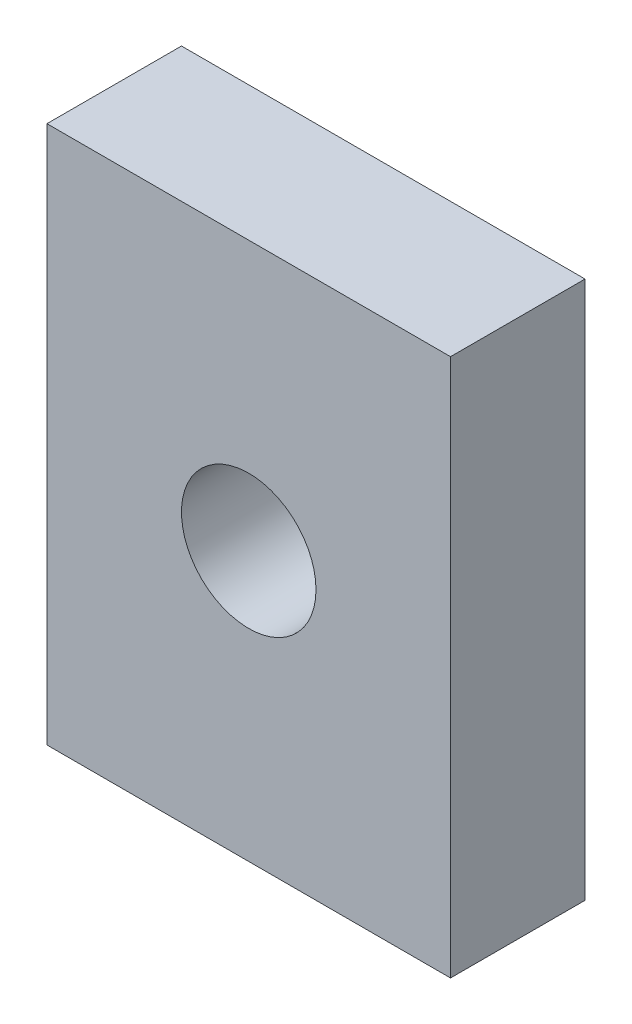
ISO-10303-21;
HEADER;
FILE_DESCRIPTION(('STEP AP214'),'2;1');
FILE_NAME('part.step','',(''),(''),'','','');
FILE_SCHEMA(('AUTOMOTIVE_DESIGN { 1 0 10303 214 1 1 1 1 }'));
ENDSEC;
DATA;
#1=APPLICATION_CONTEXT('core data for automotive mechanical design processes');
#2=APPLICATION_PROTOCOL_DEFINITION('international standard','automotive_design',2000,#1);
#3=PRODUCT_CONTEXT('',#1,'mechanical');
#4=PRODUCT('Part','Part','',(#3));
#5=PRODUCT_RELATED_PRODUCT_CATEGORY('part','',(#4));
#6=PRODUCT_DEFINITION_FORMATION('','',#4);
#7=PRODUCT_DEFINITION_CONTEXT('part definition',#1,'design');
#8=PRODUCT_DEFINITION('design','',#6,#7);
#9=PRODUCT_DEFINITION_SHAPE('','',#8);
#10=(LENGTH_UNIT() NAMED_UNIT(*) SI_UNIT(.MILLI.,.METRE.));
#11=(NAMED_UNIT(*) PLANE_ANGLE_UNIT() SI_UNIT($,.RADIAN.));
#12=(NAMED_UNIT(*) SI_UNIT($,.STERADIAN.) SOLID_ANGLE_UNIT());
#13=UNCERTAINTY_MEASURE_WITH_UNIT(LENGTH_MEASURE(1.E-05),#10,'distance_accuracy_value','');
#14=(GEOMETRIC_REPRESENTATION_CONTEXT(3) GLOBAL_UNCERTAINTY_ASSIGNED_CONTEXT((#13)) GLOBAL_UNIT_ASSIGNED_CONTEXT((#10,
#11,#12)) REPRESENTATION_CONTEXT('',''));
#15=CARTESIAN_POINT('',(0.,0.,0.));
#16=DIRECTION('',(0.,0.,1.));
#17=DIRECTION('',(1.,0.,0.));
#18=AXIS2_PLACEMENT_3D('',#15,#16,#17);
#19=CARTESIAN_POINT('',(0.,0.,5.));
#20=DIRECTION('',(0.,0.,1.));
#21=DIRECTION('',(1.,0.,0.));
#22=AXIS2_PLACEMENT_3D('',#19,#20,#21);
#23=PLANE('',#22);
#24=DIRECTION('',(0.,-1.,0.));
#25=VECTOR('',#24,1.);
#26=CARTESIAN_POINT('',(-7.5,-10.,5.));
#27=LINE('',#26,#25);
#28=CARTESIAN_POINT('',(-7.5,10.,5.));
#29=VERTEX_POINT('',#28);
#30=CARTESIAN_POINT('',(-7.5,-10.,5.));
#31=VERTEX_POINT('',#30);
#32=EDGE_CURVE('E85',#29,#31,#27,.T.);
#33=ORIENTED_EDGE('',*,*,#32,.T.);
#34=DIRECTION('',(1.,0.,0.));
#35=VECTOR('',#34,1.);
#36=CARTESIAN_POINT('',(7.5,-10.,5.));
#37=LINE('',#36,#35);
#38=CARTESIAN_POINT('',(7.5,-10.,5.));
#39=VERTEX_POINT('',#38);
#40=EDGE_CURVE('E80',#31,#39,#37,.T.);
#41=ORIENTED_EDGE('',*,*,#40,.T.);
#42=DIRECTION('',(0.,1.,0.));
#43=VECTOR('',#42,1.);
#44=CARTESIAN_POINT('',(7.5,-10.,5.));
#45=LINE('',#44,#43);
#46=CARTESIAN_POINT('',(7.5,10.,5.));
#47=VERTEX_POINT('',#46);
#48=EDGE_CURVE('E83',#39,#47,#45,.T.);
#49=ORIENTED_EDGE('',*,*,#48,.T.);
#50=DIRECTION('',(-1.,0.,0.));
#51=VECTOR('',#50,1.);
#52=CARTESIAN_POINT('',(7.5,10.,5.));
#53=LINE('',#52,#51);
#54=EDGE_CURVE('E50',#47,#29,#53,.T.);
#55=ORIENTED_EDGE('',*,*,#54,.T.);
#56=EDGE_LOOP('',(#33,#41,#49,#55));
#57=FACE_BOUND('',#56,.T.);
#58=CARTESIAN_POINT('',(0.,0.,5.));
#59=DIRECTION('',(0.,0.,1.));
#60=DIRECTION('',(1.,0.,0.));
#61=AXIS2_PLACEMENT_3D('',#58,#59,#60);
#62=CIRCLE('',#61,2.5);
#63=CARTESIAN_POINT('',(2.5,0.,5.));
#64=VERTEX_POINT('',#63);
#65=EDGE_CURVE('E100',#64,#64,#62,.T.);
#66=ORIENTED_EDGE('',*,*,#65,.F.);
#67=EDGE_LOOP('',(#66));
#68=FACE_BOUND('',#67,.T.);
#69=ADVANCED_FACE('F33',(#57,#68),#23,.T.);
#70=CARTESIAN_POINT('',(0.,0.,0.));
#71=DIRECTION('',(0.,0.,1.));
#72=DIRECTION('',(1.,0.,0.));
#73=AXIS2_PLACEMENT_3D('',#70,#71,#72);
#74=PLANE('',#73);
#75=DIRECTION('',(0.,-1.,0.));
#76=VECTOR('',#75,1.);
#77=CARTESIAN_POINT('',(-7.5,-10.,0.));
#78=LINE('',#77,#76);
#79=CARTESIAN_POINT('',(-7.5,10.,0.));
#80=VERTEX_POINT('',#79);
#81=CARTESIAN_POINT('',(-7.5,-10.,0.));
#82=VERTEX_POINT('',#81);
#83=EDGE_CURVE('E97',#80,#82,#78,.T.);
#84=ORIENTED_EDGE('',*,*,#83,.F.);
#85=DIRECTION('',(-1.,0.,0.));
#86=VECTOR('',#85,1.);
#87=CARTESIAN_POINT('',(7.5,10.,0.));
#88=LINE('',#87,#86);
#89=CARTESIAN_POINT('',(7.5,10.,0.));
#90=VERTEX_POINT('',#89);
#91=EDGE_CURVE('E73',#90,#80,#88,.T.);
#92=ORIENTED_EDGE('',*,*,#91,.F.);
#93=DIRECTION('',(0.,1.,0.));
#94=VECTOR('',#93,1.);
#95=CARTESIAN_POINT('',(7.5,-10.,0.));
#96=LINE('',#95,#94);
#97=CARTESIAN_POINT('',(7.5,-10.,0.));
#98=VERTEX_POINT('',#97);
#99=EDGE_CURVE('E67',#98,#90,#96,.T.);
#100=ORIENTED_EDGE('',*,*,#99,.F.);
#101=DIRECTION('',(1.,0.,0.));
#102=VECTOR('',#101,1.);
#103=CARTESIAN_POINT('',(7.5,-10.,0.));
#104=LINE('',#103,#102);
#105=EDGE_CURVE('E89',#82,#98,#104,.T.);
#106=ORIENTED_EDGE('',*,*,#105,.F.);
#107=EDGE_LOOP('',(#84,#92,#100,#106));
#108=FACE_BOUND('',#107,.T.);
#109=CARTESIAN_POINT('',(0.,0.,0.));
#110=DIRECTION('',(0.,0.,1.));
#111=DIRECTION('',(1.,0.,0.));
#112=AXIS2_PLACEMENT_3D('',#109,#110,#111);
#113=CIRCLE('',#112,2.5);
#114=CARTESIAN_POINT('',(2.5,0.,0.));
#115=VERTEX_POINT('',#114);
#116=EDGE_CURVE('E112',#115,#115,#113,.T.);
#117=ORIENTED_EDGE('',*,*,#116,.T.);
#118=EDGE_LOOP('',(#117));
#119=FACE_BOUND('',#118,.T.);
#120=ADVANCED_FACE('F108',(#108,#119),#74,.F.);
#121=CARTESIAN_POINT('',(-7.5,-10.,5.));
#122=DIRECTION('',(1.,0.,0.));
#123=DIRECTION('',(0.,0.,-1.));
#124=AXIS2_PLACEMENT_3D('',#121,#122,#123);
#125=PLANE('',#124);
#126=ORIENTED_EDGE('',*,*,#83,.T.);
#127=DIRECTION('',(0.,0.,-1.));
#128=VECTOR('',#127,1.);
#129=CARTESIAN_POINT('',(-7.5,-10.,5.));
#130=LINE('',#129,#128);
#131=EDGE_CURVE('E11',#31,#82,#130,.T.);
#132=ORIENTED_EDGE('',*,*,#131,.F.);
#133=ORIENTED_EDGE('',*,*,#32,.F.);
#134=DIRECTION('',(0.,0.,-1.));
#135=VECTOR('',#134,1.);
#136=CARTESIAN_POINT('',(-7.5,10.,5.));
#137=LINE('',#136,#135);
#138=EDGE_CURVE('E93',#29,#80,#137,.T.);
#139=ORIENTED_EDGE('',*,*,#138,.T.);
#140=EDGE_LOOP('',(#126,#132,#133,#139));
#141=FACE_BOUND('',#140,.T.);
#142=ADVANCED_FACE('F35',(#141),#125,.F.);
#143=CARTESIAN_POINT('',(7.5,-10.,5.));
#144=DIRECTION('',(0.,1.,0.));
#145=DIRECTION('',(0.,0.,1.));
#146=AXIS2_PLACEMENT_3D('',#143,#144,#145);
#147=PLANE('',#146);
#148=ORIENTED_EDGE('',*,*,#105,.T.);
#149=DIRECTION('',(0.,0.,-1.));
#150=VECTOR('',#149,1.);
#151=CARTESIAN_POINT('',(7.5,-10.,5.));
#152=LINE('',#151,#150);
#153=EDGE_CURVE('E42',#39,#98,#152,.T.);
#154=ORIENTED_EDGE('',*,*,#153,.F.);
#155=ORIENTED_EDGE('',*,*,#40,.F.);
#156=ORIENTED_EDGE('',*,*,#131,.T.);
#157=EDGE_LOOP('',(#148,#154,#155,#156));
#158=FACE_BOUND('',#157,.T.);
#159=ADVANCED_FACE('F88',(#158),#147,.F.);
#160=CARTESIAN_POINT('',(7.5,-10.,5.));
#161=DIRECTION('',(-1.,0.,0.));
#162=DIRECTION('',(0.,0.,1.));
#163=AXIS2_PLACEMENT_3D('',#160,#161,#162);
#164=PLANE('',#163);
#165=ORIENTED_EDGE('',*,*,#99,.T.);
#166=DIRECTION('',(0.,0.,-1.));
#167=VECTOR('',#166,1.);
#168=CARTESIAN_POINT('',(7.5,10.,5.));
#169=LINE('',#168,#167);
#170=EDGE_CURVE('E90',#47,#90,#169,.T.);
#171=ORIENTED_EDGE('',*,*,#170,.F.);
#172=ORIENTED_EDGE('',*,*,#48,.F.);
#173=ORIENTED_EDGE('',*,*,#153,.T.);
#174=EDGE_LOOP('',(#165,#171,#172,#173));
#175=FACE_BOUND('',#174,.T.);
#176=ADVANCED_FACE('F91',(#175),#164,.F.);
#177=CARTESIAN_POINT('',(7.5,10.,5.));
#178=DIRECTION('',(0.,-1.,0.));
#179=DIRECTION('',(1.,0.,0.));
#180=AXIS2_PLACEMENT_3D('',#177,#178,#179);
#181=PLANE('',#180);
#182=ORIENTED_EDGE('',*,*,#91,.T.);
#183=ORIENTED_EDGE('',*,*,#138,.F.);
#184=ORIENTED_EDGE('',*,*,#54,.F.);
#185=ORIENTED_EDGE('',*,*,#170,.T.);
#186=EDGE_LOOP('',(#182,#183,#184,#185));
#187=FACE_BOUND('',#186,.T.);
#188=ADVANCED_FACE('F105',(#187),#181,.F.);
#189=CARTESIAN_POINT('',(0.,0.,5.));
#190=DIRECTION('',(0.,0.,-1.));
#191=DIRECTION('',(-1.,0.,0.));
#192=AXIS2_PLACEMENT_3D('',#189,#190,#191);
#193=CYLINDRICAL_SURFACE('',#192,2.5);
#194=ORIENTED_EDGE('',*,*,#65,.T.);
#195=EDGE_LOOP('',(#194));
#196=FACE_BOUND('',#195,.T.);
#197=ORIENTED_EDGE('',*,*,#116,.F.);
#198=EDGE_LOOP('',(#197));
#199=FACE_BOUND('',#198,.T.);
#200=ADVANCED_FACE('F118',(#196,#199),#193,.F.);
#201=CLOSED_SHELL('',(#69,#120,#142,#159,#176,#188,#200));
#202=MANIFOLD_SOLID_BREP('B2',#201);
#203=ADVANCED_BREP_SHAPE_REPRESENTATION('',(#18,#202),#14);
#204=SHAPE_DEFINITION_REPRESENTATION(#9,#203);
ENDSEC;
END-ISO-10303-21;
